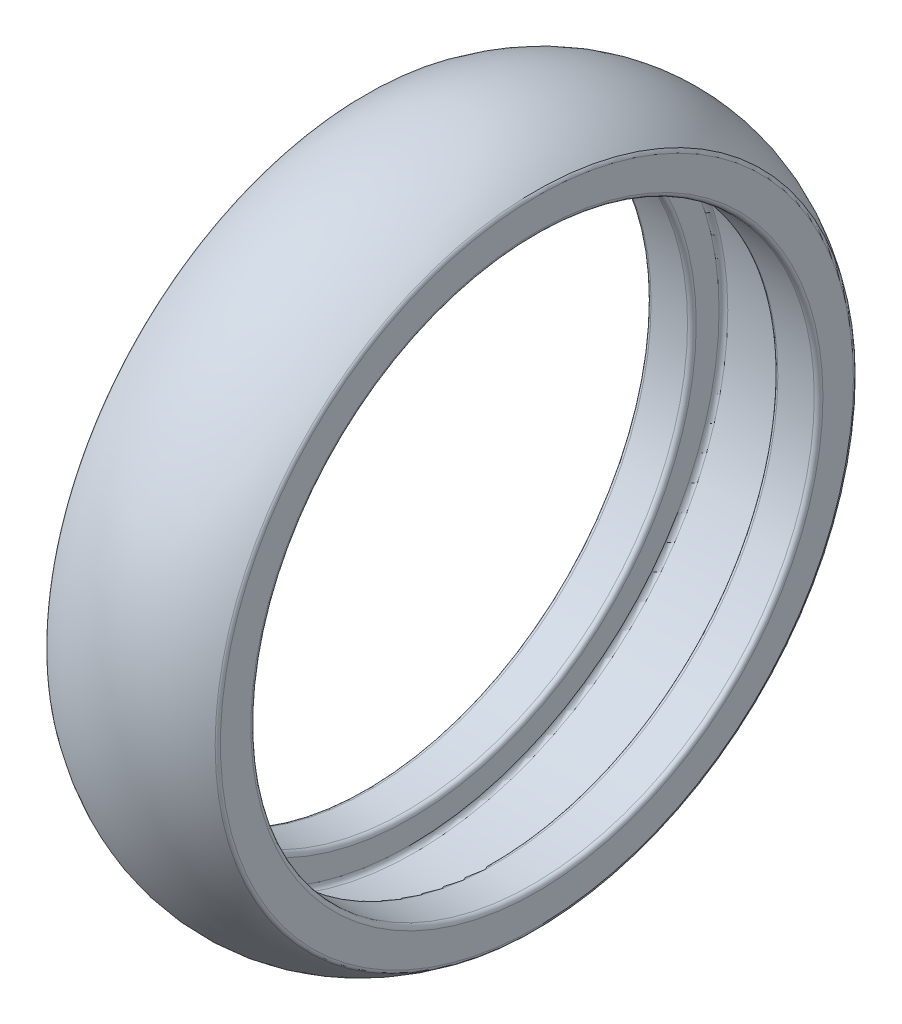
ISO-10303-21;
HEADER;
FILE_DESCRIPTION(('STEP AP214'),'2;1');
FILE_NAME('part.step','',(''),(''),'','','');
FILE_SCHEMA(('AUTOMOTIVE_DESIGN { 1 0 10303 214 1 1 1 1 }'));
ENDSEC;
DATA;
#1=APPLICATION_CONTEXT('core data for automotive mechanical design processes');
#2=APPLICATION_PROTOCOL_DEFINITION('international standard','automotive_design',2000,#1);
#3=PRODUCT_CONTEXT('',#1,'mechanical');
#4=PRODUCT('Part','Part','',(#3));
#5=PRODUCT_RELATED_PRODUCT_CATEGORY('part','',(#4));
#6=PRODUCT_DEFINITION_FORMATION('','',#4);
#7=PRODUCT_DEFINITION_CONTEXT('part definition',#1,'design');
#8=PRODUCT_DEFINITION('design','',#6,#7);
#9=PRODUCT_DEFINITION_SHAPE('','',#8);
#10=(LENGTH_UNIT() NAMED_UNIT(*) SI_UNIT(.MILLI.,.METRE.));
#11=(NAMED_UNIT(*) PLANE_ANGLE_UNIT() SI_UNIT($,.RADIAN.));
#12=(NAMED_UNIT(*) SI_UNIT($,.STERADIAN.) SOLID_ANGLE_UNIT());
#13=UNCERTAINTY_MEASURE_WITH_UNIT(LENGTH_MEASURE(1.E-05),#10,'distance_accuracy_value','');
#14=(GEOMETRIC_REPRESENTATION_CONTEXT(3) GLOBAL_UNCERTAINTY_ASSIGNED_CONTEXT((#13)) GLOBAL_UNIT_ASSIGNED_CONTEXT((#10,
#11,#12)) REPRESENTATION_CONTEXT('',''));
#15=CARTESIAN_POINT('',(0.,0.,0.));
#16=DIRECTION('',(0.,0.,1.));
#17=DIRECTION('',(1.,0.,0.));
#18=AXIS2_PLACEMENT_3D('',#15,#16,#17);
#19=CARTESIAN_POINT('',(7.9,0.,0.));
#20=DIRECTION('',(1.,0.,0.));
#21=DIRECTION('',(0.,0.,-1.));
#22=AXIS2_PLACEMENT_3D('',#19,#20,#21);
#23=PLANE('',#22);
#24=CARTESIAN_POINT('',(7.9,0.,0.));
#25=DIRECTION('',(1.,0.,0.));
#26=DIRECTION('',(0.,0.,-1.));
#27=AXIS2_PLACEMENT_3D('',#24,#25,#26);
#28=CIRCLE('',#27,26.3);
#29=CARTESIAN_POINT('',(7.9,0.,-26.3));
#30=VERTEX_POINT('',#29);
#31=EDGE_CURVE('E68',#30,#30,#28,.F.);
#32=ORIENTED_EDGE('',*,*,#31,.T.);
#33=EDGE_LOOP('',(#32));
#34=FACE_BOUND('',#33,.T.);
#35=CARTESIAN_POINT('',(7.9,0.,0.));
#36=DIRECTION('',(1.,0.,0.));
#37=DIRECTION('',(0.,0.,-1.));
#38=AXIS2_PLACEMENT_3D('',#35,#36,#37);
#39=CIRCLE('',#38,29.0989023802552);
#40=CARTESIAN_POINT('',(7.9,0.,-29.0989023802552));
#41=VERTEX_POINT('',#40);
#42=EDGE_CURVE('E71',#41,#41,#39,.T.);
#43=ORIENTED_EDGE('',*,*,#42,.T.);
#44=EDGE_LOOP('',(#43));
#45=FACE_BOUND('',#44,.T.);
#46=ADVANCED_FACE('F30',(#34,#45),#23,.T.);
#47=CARTESIAN_POINT('',(0.,0.,0.));
#48=DIRECTION('',(1.,0.,0.));
#49=DIRECTION('',(0.,0.,-1.));
#50=AXIS2_PLACEMENT_3D('',#47,#48,#49);
#51=TOROIDAL_SURFACE('',#50,18.85,13.1);
#52=CARTESIAN_POINT('',(7.73622047244095,0.,0.));
#53=DIRECTION('',(-1.,0.,0.));
#54=DIRECTION('',(0.,0.,1.));
#55=AXIS2_PLACEMENT_3D('',#52,#53,#54);
#56=CIRCLE('',#55,29.4217024552238);
#57=CARTESIAN_POINT('',(7.73622047244095,0.,29.4217024552238));
#58=VERTEX_POINT('',#57);
#59=EDGE_CURVE('E10',#58,#58,#56,.T.);
#60=ORIENTED_EDGE('',*,*,#59,.T.);
#61=EDGE_LOOP('',(#60));
#62=FACE_BOUND('',#61,.T.);
#63=CARTESIAN_POINT('',(-7.73622047244095,0.,0.));
#64=DIRECTION('',(1.,0.,0.));
#65=DIRECTION('',(0.,0.,-1.));
#66=AXIS2_PLACEMENT_3D('',#63,#64,#65);
#67=CIRCLE('',#66,29.4217024552238);
#68=CARTESIAN_POINT('',(-7.73622047244095,0.,-29.4217024552238));
#69=VERTEX_POINT('',#68);
#70=EDGE_CURVE('E37',#69,#69,#67,.T.);
#71=ORIENTED_EDGE('',*,*,#70,.T.);
#72=EDGE_LOOP('',(#71));
#73=FACE_BOUND('',#72,.T.);
#74=ADVANCED_FACE('F113',(#62,#73),#51,.T.);
#75=CARTESIAN_POINT('',(-7.9,0.,0.));
#76=DIRECTION('',(1.,0.,0.));
#77=DIRECTION('',(0.,0.,-1.));
#78=AXIS2_PLACEMENT_3D('',#75,#76,#77);
#79=PLANE('',#78);
#80=CARTESIAN_POINT('',(-7.9,0.,0.));
#81=DIRECTION('',(1.,0.,0.));
#82=DIRECTION('',(0.,0.,-1.));
#83=AXIS2_PLACEMENT_3D('',#80,#81,#82);
#84=CIRCLE('',#83,26.3);
#85=CARTESIAN_POINT('',(-7.9,0.,-26.3));
#86=VERTEX_POINT('',#85);
#87=EDGE_CURVE('E62',#86,#86,#84,.T.);
#88=ORIENTED_EDGE('',*,*,#87,.T.);
#89=EDGE_LOOP('',(#88));
#90=FACE_BOUND('',#89,.T.);
#91=CARTESIAN_POINT('',(-7.9,0.,0.));
#92=DIRECTION('',(1.,0.,0.));
#93=DIRECTION('',(0.,0.,-1.));
#94=AXIS2_PLACEMENT_3D('',#91,#92,#93);
#95=CIRCLE('',#94,29.0989023802552);
#96=CARTESIAN_POINT('',(-7.9,0.,-29.0989023802552));
#97=VERTEX_POINT('',#96);
#98=EDGE_CURVE('E65',#97,#97,#95,.F.);
#99=ORIENTED_EDGE('',*,*,#98,.T.);
#100=EDGE_LOOP('',(#99));
#101=FACE_BOUND('',#100,.T.);
#102=ADVANCED_FACE('F119',(#90,#101),#79,.F.);
#103=CARTESIAN_POINT('',(0.,0.,0.));
#104=DIRECTION('',(1.,0.,0.));
#105=DIRECTION('',(0.,0.,-1.));
#106=AXIS2_PLACEMENT_3D('',#103,#104,#105);
#107=CYLINDRICAL_SURFACE('',#106,25.9);
#108=CARTESIAN_POINT('',(-7.5,0.,0.));
#109=DIRECTION('',(1.,0.,0.));
#110=DIRECTION('',(0.,0.,-1.));
#111=AXIS2_PLACEMENT_3D('',#108,#109,#110);
#112=CIRCLE('',#111,25.9);
#113=CARTESIAN_POINT('',(-7.5,0.,-25.9));
#114=VERTEX_POINT('',#113);
#115=EDGE_CURVE('E56',#114,#114,#112,.F.);
#116=ORIENTED_EDGE('',*,*,#115,.T.);
#117=EDGE_LOOP('',(#116));
#118=FACE_BOUND('',#117,.T.);
#119=CARTESIAN_POINT('',(-4.15,0.,0.));
#120=DIRECTION('',(1.,0.,0.));
#121=DIRECTION('',(0.,0.,-1.));
#122=AXIS2_PLACEMENT_3D('',#119,#120,#121);
#123=CIRCLE('',#122,25.9);
#124=CARTESIAN_POINT('',(-4.15,0.,-25.9));
#125=VERTEX_POINT('',#124);
#126=EDGE_CURVE('E59',#125,#125,#123,.T.);
#127=ORIENTED_EDGE('',*,*,#126,.T.);
#128=EDGE_LOOP('',(#127));
#129=FACE_BOUND('',#128,.T.);
#130=ADVANCED_FACE('F109',(#118,#129),#107,.F.);
#131=CARTESIAN_POINT('',(-3.75,0.,0.));
#132=DIRECTION('',(1.,0.,0.));
#133=DIRECTION('',(0.,0.,-1.));
#134=AXIS2_PLACEMENT_3D('',#131,#132,#133);
#135=PLANE('',#134);
#136=CARTESIAN_POINT('',(-3.75,0.,0.));
#137=DIRECTION('',(1.,0.,0.));
#138=DIRECTION('',(0.,0.,-1.));
#139=AXIS2_PLACEMENT_3D('',#136,#137,#138);
#140=CIRCLE('',#139,26.3);
#141=CARTESIAN_POINT('',(-3.75,0.,-26.3));
#142=VERTEX_POINT('',#141);
#143=EDGE_CURVE('E50',#142,#142,#140,.F.);
#144=ORIENTED_EDGE('',*,*,#143,.T.);
#145=EDGE_LOOP('',(#144));
#146=FACE_BOUND('',#145,.T.);
#147=CARTESIAN_POINT('',(-3.75,0.,0.));
#148=DIRECTION('',(1.,0.,0.));
#149=DIRECTION('',(0.,0.,-1.));
#150=AXIS2_PLACEMENT_3D('',#147,#148,#149);
#151=CIRCLE('',#150,28.4);
#152=CARTESIAN_POINT('',(-3.75,0.,-28.4));
#153=VERTEX_POINT('',#152);
#154=EDGE_CURVE('E53',#153,#153,#151,.T.);
#155=ORIENTED_EDGE('',*,*,#154,.T.);
#156=EDGE_LOOP('',(#155));
#157=FACE_BOUND('',#156,.T.);
#158=ADVANCED_FACE('F99',(#146,#157),#135,.T.);
#159=CARTESIAN_POINT('',(0.,0.,0.));
#160=DIRECTION('',(1.,0.,0.));
#161=DIRECTION('',(0.,0.,-1.));
#162=AXIS2_PLACEMENT_3D('',#159,#160,#161);
#163=CYLINDRICAL_SURFACE('',#162,28.8);
#164=CARTESIAN_POINT('',(-3.35,0.,0.));
#165=DIRECTION('',(1.,0.,0.));
#166=DIRECTION('',(0.,0.,-1.));
#167=AXIS2_PLACEMENT_3D('',#164,#165,#166);
#168=CIRCLE('',#167,28.8);
#169=CARTESIAN_POINT('',(-3.35,0.,-28.8));
#170=VERTEX_POINT('',#169);
#171=EDGE_CURVE('E41',#170,#170,#168,.F.);
#172=ORIENTED_EDGE('',*,*,#171,.T.);
#173=EDGE_LOOP('',(#172));
#174=FACE_BOUND('',#173,.T.);
#175=CARTESIAN_POINT('',(3.35,0.,0.));
#176=DIRECTION('',(-1.,0.,0.));
#177=DIRECTION('',(0.,0.,1.));
#178=AXIS2_PLACEMENT_3D('',#175,#176,#177);
#179=CIRCLE('',#178,28.8);
#180=CARTESIAN_POINT('',(3.35,0.,28.8));
#181=VERTEX_POINT('',#180);
#182=EDGE_CURVE('E45',#181,#181,#179,.F.);
#183=ORIENTED_EDGE('',*,*,#182,.T.);
#184=EDGE_LOOP('',(#183));
#185=FACE_BOUND('',#184,.T.);
#186=ADVANCED_FACE('F97',(#174,#185),#163,.F.);
#187=CARTESIAN_POINT('',(3.75,0.,0.));
#188=DIRECTION('',(-1.,0.,0.));
#189=DIRECTION('',(0.,0.,1.));
#190=AXIS2_PLACEMENT_3D('',#187,#188,#189);
#191=PLANE('',#190);
#192=CARTESIAN_POINT('',(3.75,0.,0.));
#193=DIRECTION('',(-1.,0.,0.));
#194=DIRECTION('',(0.,0.,1.));
#195=AXIS2_PLACEMENT_3D('',#192,#193,#194);
#196=CIRCLE('',#195,26.3);
#197=CARTESIAN_POINT('',(3.75,0.,26.3));
#198=VERTEX_POINT('',#197);
#199=EDGE_CURVE('E80',#198,#198,#196,.F.);
#200=ORIENTED_EDGE('',*,*,#199,.T.);
#201=EDGE_LOOP('',(#200));
#202=FACE_BOUND('',#201,.T.);
#203=CARTESIAN_POINT('',(3.75,0.,0.));
#204=DIRECTION('',(-1.,0.,0.));
#205=DIRECTION('',(0.,0.,1.));
#206=AXIS2_PLACEMENT_3D('',#203,#204,#205);
#207=CIRCLE('',#206,28.4);
#208=CARTESIAN_POINT('',(3.75,0.,28.4));
#209=VERTEX_POINT('',#208);
#210=EDGE_CURVE('E83',#209,#209,#207,.T.);
#211=ORIENTED_EDGE('',*,*,#210,.T.);
#212=EDGE_LOOP('',(#211));
#213=FACE_BOUND('',#212,.T.);
#214=ADVANCED_FACE('F87',(#202,#213),#191,.T.);
#215=CARTESIAN_POINT('',(0.,0.,0.));
#216=DIRECTION('',(1.,0.,0.));
#217=DIRECTION('',(0.,0.,-1.));
#218=AXIS2_PLACEMENT_3D('',#215,#216,#217);
#219=CYLINDRICAL_SURFACE('',#218,25.9);
#220=CARTESIAN_POINT('',(4.15,0.,0.));
#221=DIRECTION('',(-1.,0.,0.));
#222=DIRECTION('',(0.,0.,1.));
#223=AXIS2_PLACEMENT_3D('',#220,#221,#222);
#224=CIRCLE('',#223,25.9);
#225=CARTESIAN_POINT('',(4.15,0.,25.9));
#226=VERTEX_POINT('',#225);
#227=EDGE_CURVE('E74',#226,#226,#224,.T.);
#228=ORIENTED_EDGE('',*,*,#227,.T.);
#229=EDGE_LOOP('',(#228));
#230=FACE_BOUND('',#229,.T.);
#231=CARTESIAN_POINT('',(7.5,0.,0.));
#232=DIRECTION('',(1.,0.,0.));
#233=DIRECTION('',(0.,0.,-1.));
#234=AXIS2_PLACEMENT_3D('',#231,#232,#233);
#235=CIRCLE('',#234,25.9);
#236=CARTESIAN_POINT('',(7.5,0.,-25.9));
#237=VERTEX_POINT('',#236);
#238=EDGE_CURVE('E77',#237,#237,#235,.T.);
#239=ORIENTED_EDGE('',*,*,#238,.T.);
#240=EDGE_LOOP('',(#239));
#241=FACE_BOUND('',#240,.T.);
#242=ADVANCED_FACE('F106',(#230,#241),#219,.F.);
#243=CARTESIAN_POINT('',(4.15,0.,0.));
#244=DIRECTION('',(-1.,0.,0.));
#245=DIRECTION('',(0.,0.,1.));
#246=AXIS2_PLACEMENT_3D('',#243,#244,#245);
#247=TOROIDAL_SURFACE('',#246,26.3,0.4);
#248=ORIENTED_EDGE('',*,*,#227,.F.);
#249=EDGE_LOOP('',(#248));
#250=FACE_BOUND('',#249,.T.);
#251=ORIENTED_EDGE('',*,*,#199,.F.);
#252=EDGE_LOOP('',(#251));
#253=FACE_BOUND('',#252,.T.);
#254=ADVANCED_FACE('F124',(#250,#253),#247,.T.);
#255=CARTESIAN_POINT('',(7.5,0.,0.));
#256=DIRECTION('',(1.,0.,0.));
#257=DIRECTION('',(0.,0.,-1.));
#258=AXIS2_PLACEMENT_3D('',#255,#256,#257);
#259=TOROIDAL_SURFACE('',#258,26.3,0.4);
#260=ORIENTED_EDGE('',*,*,#31,.F.);
#261=EDGE_LOOP('',(#260));
#262=FACE_BOUND('',#261,.T.);
#263=ORIENTED_EDGE('',*,*,#238,.F.);
#264=EDGE_LOOP('',(#263));
#265=FACE_BOUND('',#264,.T.);
#266=ADVANCED_FACE('F127',(#262,#265),#259,.T.);
#267=CARTESIAN_POINT('',(-7.5,0.,0.));
#268=DIRECTION('',(1.,0.,0.));
#269=DIRECTION('',(0.,0.,-1.));
#270=AXIS2_PLACEMENT_3D('',#267,#268,#269);
#271=TOROIDAL_SURFACE('',#270,26.3,0.4);
#272=ORIENTED_EDGE('',*,*,#115,.F.);
#273=EDGE_LOOP('',(#272));
#274=FACE_BOUND('',#273,.T.);
#275=ORIENTED_EDGE('',*,*,#87,.F.);
#276=EDGE_LOOP('',(#275));
#277=FACE_BOUND('',#276,.T.);
#278=ADVANCED_FACE('F131',(#274,#277),#271,.T.);
#279=CARTESIAN_POINT('',(-4.15,0.,0.));
#280=DIRECTION('',(1.,0.,0.));
#281=DIRECTION('',(0.,0.,-1.));
#282=AXIS2_PLACEMENT_3D('',#279,#280,#281);
#283=TOROIDAL_SURFACE('',#282,26.3,0.4);
#284=ORIENTED_EDGE('',*,*,#143,.F.);
#285=EDGE_LOOP('',(#284));
#286=FACE_BOUND('',#285,.T.);
#287=ORIENTED_EDGE('',*,*,#126,.F.);
#288=EDGE_LOOP('',(#287));
#289=FACE_BOUND('',#288,.T.);
#290=ADVANCED_FACE('F135',(#286,#289),#283,.T.);
#291=CARTESIAN_POINT('',(-3.35,0.,0.));
#292=DIRECTION('',(1.,0.,0.));
#293=DIRECTION('',(0.,0.,-1.));
#294=AXIS2_PLACEMENT_3D('',#291,#292,#293);
#295=TOROIDAL_SURFACE('',#294,28.4,0.4);
#296=ORIENTED_EDGE('',*,*,#171,.F.);
#297=EDGE_LOOP('',(#296));
#298=FACE_BOUND('',#297,.T.);
#299=ORIENTED_EDGE('',*,*,#154,.F.);
#300=EDGE_LOOP('',(#299));
#301=FACE_BOUND('',#300,.T.);
#302=ADVANCED_FACE('F93',(#298,#301),#295,.F.);
#303=CARTESIAN_POINT('',(3.35,0.,0.));
#304=DIRECTION('',(-1.,0.,0.));
#305=DIRECTION('',(0.,0.,1.));
#306=AXIS2_PLACEMENT_3D('',#303,#304,#305);
#307=TOROIDAL_SURFACE('',#306,28.4,0.4);
#308=ORIENTED_EDGE('',*,*,#210,.F.);
#309=EDGE_LOOP('',(#308));
#310=FACE_BOUND('',#309,.T.);
#311=ORIENTED_EDGE('',*,*,#182,.F.);
#312=EDGE_LOOP('',(#311));
#313=FACE_BOUND('',#312,.T.);
#314=ADVANCED_FACE('F89',(#310,#313),#307,.F.);
#315=CARTESIAN_POINT('',(7.5,0.,0.));
#316=DIRECTION('',(1.,0.,0.));
#317=DIRECTION('',(0.,0.,-1.));
#318=AXIS2_PLACEMENT_3D('',#315,#316,#317);
#319=TOROIDAL_SURFACE('',#318,29.0989023802552,0.4);
#320=ORIENTED_EDGE('',*,*,#59,.F.);
#321=EDGE_LOOP('',(#320));
#322=FACE_BOUND('',#321,.T.);
#323=ORIENTED_EDGE('',*,*,#42,.F.);
#324=EDGE_LOOP('',(#323));
#325=FACE_BOUND('',#324,.T.);
#326=ADVANCED_FACE('F92',(#322,#325),#319,.T.);
#327=CARTESIAN_POINT('',(-7.5,0.,0.));
#328=DIRECTION('',(1.,0.,0.));
#329=DIRECTION('',(0.,0.,-1.));
#330=AXIS2_PLACEMENT_3D('',#327,#328,#329);
#331=TOROIDAL_SURFACE('',#330,29.0989023802552,0.4);
#332=ORIENTED_EDGE('',*,*,#98,.F.);
#333=EDGE_LOOP('',(#332));
#334=FACE_BOUND('',#333,.T.);
#335=ORIENTED_EDGE('',*,*,#70,.F.);
#336=EDGE_LOOP('',(#335));
#337=FACE_BOUND('',#336,.T.);
#338=ADVANCED_FACE('F32',(#334,#337),#331,.T.);
#339=CLOSED_SHELL('',(#46,#74,#102,#130,#158,#186,#214,#242,#254,#266,#278,#290,#302,#314,#326,#338));
#340=MANIFOLD_SOLID_BREP('B2',#339);
#341=ADVANCED_BREP_SHAPE_REPRESENTATION('',(#18,#340),#14);
#342=SHAPE_DEFINITION_REPRESENTATION(#9,#341);
ENDSEC;
END-ISO-10303-21;
